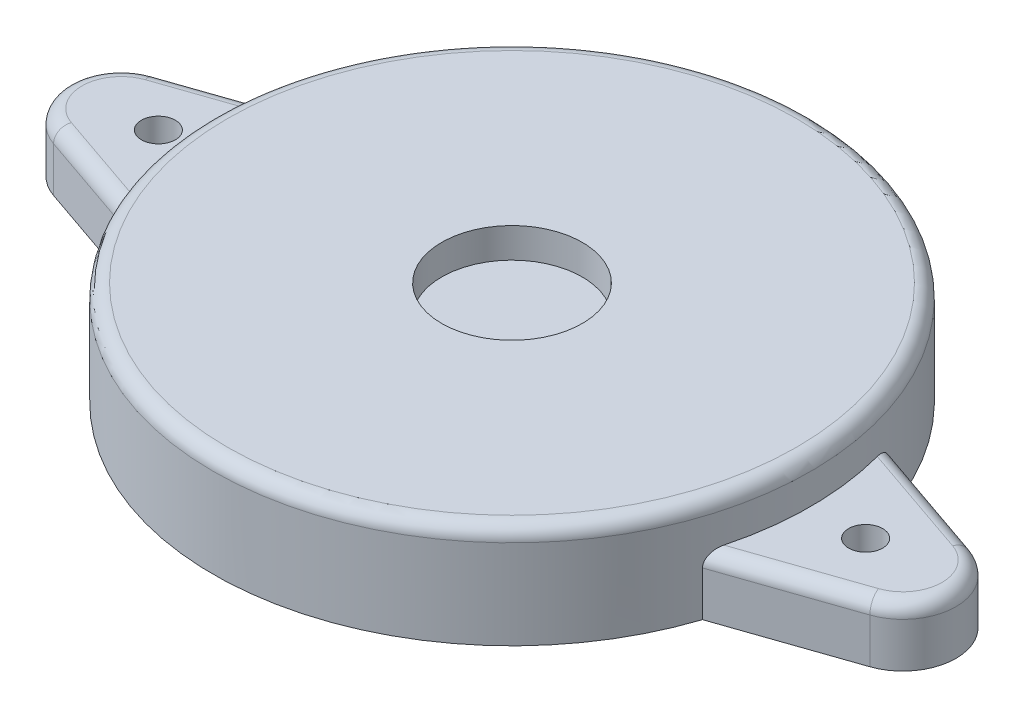
ISO-10303-21;
HEADER;
FILE_DESCRIPTION(('STEP AP214'),'2;1');
FILE_NAME('part.step','',(''),(''),'','','');
FILE_SCHEMA(('AUTOMOTIVE_DESIGN { 1 0 10303 214 1 1 1 1 }'));
ENDSEC;
DATA;
#1=APPLICATION_CONTEXT('core data for automotive mechanical design processes');
#2=APPLICATION_PROTOCOL_DEFINITION('international standard','automotive_design',2000,#1);
#3=PRODUCT_CONTEXT('',#1,'mechanical');
#4=PRODUCT('Part','Part','',(#3));
#5=PRODUCT_RELATED_PRODUCT_CATEGORY('part','',(#4));
#6=PRODUCT_DEFINITION_FORMATION('','',#4);
#7=PRODUCT_DEFINITION_CONTEXT('part definition',#1,'design');
#8=PRODUCT_DEFINITION('design','',#6,#7);
#9=PRODUCT_DEFINITION_SHAPE('','',#8);
#10=(LENGTH_UNIT() NAMED_UNIT(*) SI_UNIT(.MILLI.,.METRE.));
#11=(NAMED_UNIT(*) PLANE_ANGLE_UNIT() SI_UNIT($,.RADIAN.));
#12=(NAMED_UNIT(*) SI_UNIT($,.STERADIAN.) SOLID_ANGLE_UNIT());
#13=UNCERTAINTY_MEASURE_WITH_UNIT(LENGTH_MEASURE(1.E-05),#10,'distance_accuracy_value','');
#14=(GEOMETRIC_REPRESENTATION_CONTEXT(3) GLOBAL_UNCERTAINTY_ASSIGNED_CONTEXT((#13)) GLOBAL_UNIT_ASSIGNED_CONTEXT((#10,
#11,#12)) REPRESENTATION_CONTEXT('',''));
#15=CARTESIAN_POINT('',(0.,0.,0.));
#16=DIRECTION('',(0.,0.,1.));
#17=DIRECTION('',(1.,0.,0.));
#18=AXIS2_PLACEMENT_3D('',#15,#16,#17);
#19=CARTESIAN_POINT('',(0.,5.16,0.));
#20=DIRECTION('',(0.,-1.,0.));
#21=DIRECTION('',(0.,0.,-1.));
#22=AXIS2_PLACEMENT_3D('',#19,#20,#21);
#23=CYLINDRICAL_SURFACE('',#22,14.93);
#24=CARTESIAN_POINT('',(0.,4.46,0.));
#25=DIRECTION('',(0.,1.,0.));
#26=DIRECTION('',(0.,0.,1.));
#27=AXIS2_PLACEMENT_3D('',#24,#25,#26);
#28=CIRCLE('',#27,14.93);
#29=CARTESIAN_POINT('',(0.,4.46,14.93));
#30=VERTEX_POINT('',#29);
#31=EDGE_CURVE('E200',#30,#30,#28,.F.);
#32=ORIENTED_EDGE('',*,*,#31,.T.);
#33=EDGE_LOOP('',(#32));
#34=FACE_BOUND('',#33,.T.);
#35=CARTESIAN_POINT('',(0.,2.94,0.));
#36=DIRECTION('',(0.,-1.,0.));
#37=DIRECTION('',(0.,0.,-1.));
#38=AXIS2_PLACEMENT_3D('',#35,#36,#37);
#39=CIRCLE('',#38,14.93);
#40=CARTESIAN_POINT('',(-14.429087598297,2.94,3.8348834507287));
#41=VERTEX_POINT('',#40);
#42=CARTESIAN_POINT('',(-14.429087598297,2.94,-3.8348834507287));
#43=VERTEX_POINT('',#42);
#44=EDGE_CURVE('E161',#41,#43,#39,.T.);
#45=ORIENTED_EDGE('',*,*,#44,.F.);
#46=CARTESIAN_POINT('',(-14.429087598297,2.94,3.8348834507287));
#47=CARTESIAN_POINT('',(-14.4138774173166,2.93997814055828,3.8921743099573));
#48=CARTESIAN_POINT('',(-14.3982845537592,2.93480887956589,3.94941011262203));
#49=CARTESIAN_POINT('',(-14.3667965768096,2.91417210982097,4.06243771924972));
#50=CARTESIAN_POINT('',(-14.3509000239146,2.89861824672489,4.11821330467232));
#51=CARTESIAN_POINT('',(-14.3202531008862,2.85814754029159,4.22352402585155));
#52=CARTESIAN_POINT('',(-14.305483406981,2.83368591733759,4.2732273044714));
#53=CARTESIAN_POINT('',(-14.2771239902179,2.77541682636606,4.3670362653395));
#54=CARTESIAN_POINT('',(-14.2635295644546,2.74164911083228,4.41116461783673));
#55=CARTESIAN_POINT('',(-14.242478513252,2.67726120224456,4.47856390047529));
#56=CARTESIAN_POINT('',(-14.2344480605328,2.64907861241899,4.50399564814046));
#57=CARTESIAN_POINT('',(-14.219760478293,2.58871728969254,4.5501534800078));
#58=CARTESIAN_POINT('',(-14.2131033739341,2.5565384835928,4.57087947799488));
#59=CARTESIAN_POINT('',(-14.2015511147571,2.48845281904667,4.60664798740863));
#60=CARTESIAN_POINT('',(-14.1966728144079,2.45251425129202,4.6216361955794));
#61=CARTESIAN_POINT('',(-14.1892028208415,2.37825680983918,4.64452074193722));
#62=CARTESIAN_POINT('',(-14.1866043877521,2.33994531310194,4.65243798496127));
#63=CARTESIAN_POINT('',(-14.1849214181625,2.29108472920955,4.6575642029491));
#64=CARTESIAN_POINT('',(-14.1846584788022,2.28087987559489,4.6583649206828));
#65=CARTESIAN_POINT('',(-14.1843080413889,2.26045175313608,4.65943195312917));
#66=CARTESIAN_POINT('',(-14.184220329351,2.25022852203119,4.659698919651));
#67=CARTESIAN_POINT('',(-14.1842199529482,2.24,4.65970002536481));
#68=B_SPLINE_CURVE_WITH_KNOTS('',3,(#46,#47,#48,#49,#50,#51,#52,#53,#54,#55,#56,#57,#58,#59,#60,
#61,#62,#63,#64,#65,#66,#67),.UNSPECIFIED.,.F.,.F.,(4,2,2,2,2,2,2,2,2,2,4),(0.,
0.177689420451845,0.356875152519502,0.527957754312332,0.698320583460933,0.814287444919781,
0.930256430862166,1.04729732013803,1.16399102929701,1.19469972106421,1.22537088886555),.UNSPECIFIED.);
#69=CARTESIAN_POINT('',(-14.1842199529482,2.24,4.65970002536481));
#70=VERTEX_POINT('',#69);
#71=EDGE_CURVE('E44',#41,#70,#68,.T.);
#72=ORIENTED_EDGE('',*,*,#71,.T.);
#73=DIRECTION('',(0.,-1.,0.));
#74=VECTOR('',#73,1.);
#75=CARTESIAN_POINT('',(-14.1842199529482,2.94,4.65970002536481));
#76=LINE('',#75,#74);
#77=CARTESIAN_POINT('',(-14.1842199529482,0.,4.65970002536481));
#78=VERTEX_POINT('',#77);
#79=EDGE_CURVE('E136',#70,#78,#76,.T.);
#80=ORIENTED_EDGE('',*,*,#79,.T.);
#81=CARTESIAN_POINT('',(0.,0.,0.));
#82=DIRECTION('',(0.,1.,0.));
#83=DIRECTION('',(0.,0.,1.));
#84=AXIS2_PLACEMENT_3D('',#81,#82,#83);
#85=CIRCLE('',#84,14.93);
#86=CARTESIAN_POINT('',(14.1842199529483,0.,4.65970002536481));
#87=VERTEX_POINT('',#86);
#88=EDGE_CURVE('E148',#78,#87,#85,.T.);
#89=ORIENTED_EDGE('',*,*,#88,.T.);
#90=DIRECTION('',(0.,-1.,0.));
#91=VECTOR('',#90,1.);
#92=CARTESIAN_POINT('',(14.1842199529482,2.94,4.65970002536481));
#93=LINE('',#92,#91);
#94=CARTESIAN_POINT('',(14.1842199529482,2.24,4.65970002536481));
#95=VERTEX_POINT('',#94);
#96=EDGE_CURVE('E192',#95,#87,#93,.T.);
#97=ORIENTED_EDGE('',*,*,#96,.F.);
#98=CARTESIAN_POINT('',(14.1842199529482,2.24,4.65970002536481));
#99=CARTESIAN_POINT('',(14.1842190896717,2.25693649452195,4.65970201646287));
#100=CARTESIAN_POINT('',(14.184461026523,2.27386343904716,4.6589662491817));
#101=CARTESIAN_POINT('',(14.1854202016541,2.30756925031859,4.65604524308534));
#102=CARTESIAN_POINT('',(14.1861371831797,2.32434819209661,4.65386078726296));
#103=CARTESIAN_POINT('',(14.1889722437595,2.37406195090137,4.64521313316511));
#104=CARTESIAN_POINT('',(14.1917747600945,2.40661629321092,4.63665481022352));
#105=CARTESIAN_POINT('',(14.1989974675529,2.46965652039576,4.61448848816677));
#106=CARTESIAN_POINT('',(14.2034147720633,2.50014598190755,4.60088949919917));
#107=CARTESIAN_POINT('',(14.2135990146769,2.55856601677584,4.5693300993658));
#108=CARTESIAN_POINT('',(14.219367887,2.58649284229407,4.55136343655123));
#109=CARTESIAN_POINT('',(14.2324496611259,2.64139553893826,4.5102964837884));
#110=CARTESIAN_POINT('',(14.239847031579,2.66813434631393,4.48690821546017));
#111=CARTESIAN_POINT('',(14.255543759827,2.71792964715898,4.4367851705581));
#112=CARTESIAN_POINT('',(14.2638433119251,2.74098534474529,4.41004967290192));
#113=CARTESIAN_POINT('',(14.282757982286,2.78748441236427,4.34844257702542));
#114=CARTESIAN_POINT('',(14.2935083015561,2.81011977276594,4.3130029102126));
#115=CARTESIAN_POINT('',(14.3155306560991,2.84999580013863,4.23933536231764));
#116=CARTESIAN_POINT('',(14.326803306577,2.86722991003768,4.2011041611923));
#117=CARTESIAN_POINT('',(14.3516786781012,2.89899127627244,4.11540518367075));
#118=CARTESIAN_POINT('',(14.3653248558078,2.91241908179589,4.06754191138568));
#119=CARTESIAN_POINT('',(14.3924909249222,2.93160860206077,3.97034534492567));
#120=CARTESIAN_POINT('',(14.4060109908642,2.93738324223114,3.92101467352165));
#121=CARTESIAN_POINT('',(14.4225769534227,2.9397641173255,3.85931833082634));
#122=CARTESIAN_POINT('',(14.4258406872819,2.94000004110343,3.8471010798203));
#123=CARTESIAN_POINT('',(14.429087598297,2.94,3.8348834507287));
#124=B_SPLINE_CURVE_WITH_KNOTS('',3,(#98,#99,#100,#101,#102,#103,#104,#105,#106,#107,#108,#109,
#110,#111,#112,#113,#114,#115,#116,#117,#118,#119,#120,#121,#122,#123),.UNSPECIFIED.,.F.,.F.,(4,
2,2,2,2,2,2,2,2,2,2,2,4),(0.,0.0507734722109093,0.101519524519104,0.202294433131119,
0.302890069371643,0.403630556349275,0.512094664936698,0.620582179917424,0.750311736923561,
0.880198179861179,1.03423986539473,1.18802105701897,1.22595505623296),.UNSPECIFIED.);
#125=CARTESIAN_POINT('',(14.429087598297,2.94,3.8348834507287));
#126=VERTEX_POINT('',#125);
#127=EDGE_CURVE('E11',#95,#126,#124,.T.);
#128=ORIENTED_EDGE('',*,*,#127,.T.);
#129=CARTESIAN_POINT('',(0.,2.94,0.));
#130=DIRECTION('',(0.,-1.,0.));
#131=DIRECTION('',(0.,0.,1.));
#132=AXIS2_PLACEMENT_3D('',#129,#130,#131);
#133=CIRCLE('',#132,14.93);
#134=CARTESIAN_POINT('',(14.429087598297,2.94,-3.8348834507287));
#135=VERTEX_POINT('',#134);
#136=EDGE_CURVE('E175',#135,#126,#133,.T.);
#137=ORIENTED_EDGE('',*,*,#136,.F.);
#138=CARTESIAN_POINT('',(14.429087598297,2.94,-3.8348834507287));
#139=CARTESIAN_POINT('',(14.4138774173166,2.93997814055828,-3.8921743099573));
#140=CARTESIAN_POINT('',(14.3982845537592,2.93480887956589,-3.94941011262203));
#141=CARTESIAN_POINT('',(14.3667965768096,2.91417210982097,-4.06243771924972));
#142=CARTESIAN_POINT('',(14.3509000239146,2.89861824672489,-4.11821330467232));
#143=CARTESIAN_POINT('',(14.3202531008862,2.85814754029159,-4.22352402585155));
#144=CARTESIAN_POINT('',(14.305483406981,2.83368591733758,-4.2732273044714));
#145=CARTESIAN_POINT('',(14.2771239902179,2.77541682636606,-4.3670362653395));
#146=CARTESIAN_POINT('',(14.2635295644546,2.74164911083227,-4.41116461783674));
#147=CARTESIAN_POINT('',(14.242478513252,2.67726120224456,-4.47856390047529));
#148=CARTESIAN_POINT('',(14.2344480605328,2.64907861241899,-4.50399564814046));
#149=CARTESIAN_POINT('',(14.219760478293,2.58871728969254,-4.5501534800078));
#150=CARTESIAN_POINT('',(14.2131033739341,2.5565384835928,-4.57087947799488));
#151=CARTESIAN_POINT('',(14.2015511147571,2.48845281904666,-4.60664798740864));
#152=CARTESIAN_POINT('',(14.1966728144079,2.45251425129201,-4.6216361955794));
#153=CARTESIAN_POINT('',(14.1892028208415,2.37825680983918,-4.64452074193722));
#154=CARTESIAN_POINT('',(14.1866043877521,2.33994531310193,-4.65243798496127));
#155=CARTESIAN_POINT('',(14.1849214181625,2.29108472920955,-4.6575642029491));
#156=CARTESIAN_POINT('',(14.1846584788022,2.28087987559489,-4.6583649206828));
#157=CARTESIAN_POINT('',(14.1843080413889,2.26045175313608,-4.65943195312917));
#158=CARTESIAN_POINT('',(14.184220329351,2.25022852203119,-4.659698919651));
#159=CARTESIAN_POINT('',(14.1842199529482,2.24,-4.65970002536481));
#160=B_SPLINE_CURVE_WITH_KNOTS('',3,(#138,#139,#140,#141,#142,#143,#144,#145,#146,#147,#148,
#149,#150,#151,#152,#153,#154,#155,#156,#157,#158,#159),.UNSPECIFIED.,.F.,.F.,(4,2,2,2,2,2,2,2,
2,2,4),(0.,0.177689420451847,0.356875152519503,0.527957754312334,0.698320583460934,
0.814287444919785,0.930256430862171,1.04729732013804,1.16399102929701,1.19469972106422,
1.22537088886555),.UNSPECIFIED.);
#161=CARTESIAN_POINT('',(14.1842199529482,2.24,-4.65970002536481));
#162=VERTEX_POINT('',#161);
#163=EDGE_CURVE('E235',#135,#162,#160,.T.);
#164=ORIENTED_EDGE('',*,*,#163,.T.);
#165=DIRECTION('',(0.,-1.,0.));
#166=VECTOR('',#165,1.);
#167=CARTESIAN_POINT('',(14.1842199529482,2.94,-4.65970002536481));
#168=LINE('',#167,#166);
#169=CARTESIAN_POINT('',(14.1842199529482,0.,-4.65970002536481));
#170=VERTEX_POINT('',#169);
#171=EDGE_CURVE('E178',#162,#170,#168,.T.);
#172=ORIENTED_EDGE('',*,*,#171,.T.);
#173=CARTESIAN_POINT('',(-14.1842199529483,0.,-4.65970002536481));
#174=VERTEX_POINT('',#173);
#175=EDGE_CURVE('E194',#170,#174,#85,.T.);
#176=ORIENTED_EDGE('',*,*,#175,.T.);
#177=DIRECTION('',(0.,-1.,0.));
#178=VECTOR('',#177,1.);
#179=CARTESIAN_POINT('',(-14.1842199529482,2.94,-4.65970002536481));
#180=LINE('',#179,#178);
#181=CARTESIAN_POINT('',(-14.1842199529482,2.24,-4.65970002536481));
#182=VERTEX_POINT('',#181);
#183=EDGE_CURVE('E166',#182,#174,#180,.T.);
#184=ORIENTED_EDGE('',*,*,#183,.F.);
#185=CARTESIAN_POINT('',(-14.1842199529482,2.24,-4.65970002536481));
#186=CARTESIAN_POINT('',(-14.1842190896717,2.25693649452195,-4.65970201646287));
#187=CARTESIAN_POINT('',(-14.184461026523,2.27386343904716,-4.6589662491817));
#188=CARTESIAN_POINT('',(-14.1854202016541,2.30756925031859,-4.65604524308534));
#189=CARTESIAN_POINT('',(-14.1861371831797,2.32434819209661,-4.65386078726296));
#190=CARTESIAN_POINT('',(-14.1889722437595,2.37406195090137,-4.64521313316511));
#191=CARTESIAN_POINT('',(-14.1917747600945,2.40661629321092,-4.63665481022352));
#192=CARTESIAN_POINT('',(-14.1989974675529,2.46965652039576,-4.61448848816677));
#193=CARTESIAN_POINT('',(-14.2034147720633,2.50014598190755,-4.60088949919916));
#194=CARTESIAN_POINT('',(-14.2135990146769,2.55856601677584,-4.5693300993658));
#195=CARTESIAN_POINT('',(-14.219367887,2.58649284229407,-4.55136343655123));
#196=CARTESIAN_POINT('',(-14.2324496611259,2.64139553893826,-4.5102964837884));
#197=CARTESIAN_POINT('',(-14.239847031579,2.66813434631393,-4.48690821546017));
#198=CARTESIAN_POINT('',(-14.255543759827,2.71792964715898,-4.4367851705581));
#199=CARTESIAN_POINT('',(-14.2638433119251,2.74098534474529,-4.41004967290191));
#200=CARTESIAN_POINT('',(-14.282757982286,2.78748441236427,-4.34844257702541));
#201=CARTESIAN_POINT('',(-14.2935083015561,2.81011977276594,-4.3130029102126));
#202=CARTESIAN_POINT('',(-14.3155306560991,2.84999580013863,-4.23933536231764));
#203=CARTESIAN_POINT('',(-14.326803306577,2.86722991003768,-4.2011041611923));
#204=CARTESIAN_POINT('',(-14.3516786781012,2.89899127627244,-4.11540518367075));
#205=CARTESIAN_POINT('',(-14.3653248558078,2.91241908179589,-4.06754191138568));
#206=CARTESIAN_POINT('',(-14.3924909249222,2.93160860206077,-3.97034534492567));
#207=CARTESIAN_POINT('',(-14.4060109908642,2.93738324223114,-3.92101467352165));
#208=CARTESIAN_POINT('',(-14.4225769534227,2.9397641173255,-3.85931833082634));
#209=CARTESIAN_POINT('',(-14.4258406872819,2.94000004110343,-3.8471010798203));
#210=CARTESIAN_POINT('',(-14.429087598297,2.94,-3.8348834507287));
#211=B_SPLINE_CURVE_WITH_KNOTS('',3,(#185,#186,#187,#188,#189,#190,#191,#192,#193,#194,#195,
#196,#197,#198,#199,#200,#201,#202,#203,#204,#205,#206,#207,#208,#209,#210),.UNSPECIFIED.,.F.,
.F.,(4,2,2,2,2,2,2,2,2,2,2,2,4),(0.,0.0507734722109094,0.101519524519103,0.202294433131119,
0.302890069371642,0.403630556349275,0.512094664936698,0.620582179917423,0.75031173692356,
0.880198179861176,1.03423986539473,1.18802105701897,1.22595505623296),.UNSPECIFIED.);
#212=EDGE_CURVE('E227',#182,#43,#211,.T.);
#213=ORIENTED_EDGE('',*,*,#212,.T.);
#214=EDGE_LOOP('',(#45,#72,#80,#89,#97,#128,#137,#164,#172,#176,#184,#213));
#215=FACE_BOUND('',#214,.T.);
#216=ADVANCED_FACE('F34',(#34,#215),#23,.T.);
#217=CARTESIAN_POINT('',(0.,5.16,0.));
#218=DIRECTION('',(0.,1.,0.));
#219=DIRECTION('',(0.,0.,1.));
#220=AXIS2_PLACEMENT_3D('',#217,#218,#219);
#221=PLANE('',#220);
#222=CARTESIAN_POINT('',(0.,5.16,0.));
#223=DIRECTION('',(0.,1.,0.));
#224=DIRECTION('',(0.,0.,1.));
#225=AXIS2_PLACEMENT_3D('',#222,#223,#224);
#226=CIRCLE('',#225,3.515);
#227=CARTESIAN_POINT('',(0.,5.16,3.515));
#228=VERTEX_POINT('',#227);
#229=EDGE_CURVE('E283',#228,#228,#226,.T.);
#230=ORIENTED_EDGE('',*,*,#229,.F.);
#231=EDGE_LOOP('',(#230));
#232=FACE_BOUND('',#231,.T.);
#233=CARTESIAN_POINT('',(0.,5.16,0.));
#234=DIRECTION('',(0.,1.,0.));
#235=DIRECTION('',(0.,0.,1.));
#236=AXIS2_PLACEMENT_3D('',#233,#234,#235);
#237=CIRCLE('',#236,14.23);
#238=CARTESIAN_POINT('',(0.,5.16,14.23));
#239=VERTEX_POINT('',#238);
#240=EDGE_CURVE('E197',#239,#239,#237,.T.);
#241=ORIENTED_EDGE('',*,*,#240,.T.);
#242=EDGE_LOOP('',(#241));
#243=FACE_BOUND('',#242,.T.);
#244=ADVANCED_FACE('F308',(#232,#243),#221,.T.);
#245=CARTESIAN_POINT('',(0.,0.,0.));
#246=DIRECTION('',(0.,1.,0.));
#247=DIRECTION('',(0.,0.,1.));
#248=AXIS2_PLACEMENT_3D('',#245,#246,#247);
#249=PLANE('',#248);
#250=ORIENTED_EDGE('',*,*,#175,.F.);
#251=DIRECTION('',(-0.945415498264678,0.,-0.325867358968263));
#252=VECTOR('',#251,1.);
#253=CARTESIAN_POINT('',(14.1842199529482,0.,-4.65970002536481));
#254=LINE('',#253,#252);
#255=CARTESIAN_POINT('',(20.4067284526636,0.,-2.51491562667268));
#256=VERTEX_POINT('',#255);
#257=EDGE_CURVE('E179',#256,#170,#254,.T.);
#258=ORIENTED_EDGE('',*,*,#257,.F.);
#259=CARTESIAN_POINT('',(19.5398832245115,0.,0.));
#260=DIRECTION('',(0.,1.,0.));
#261=DIRECTION('',(0.,0.,1.));
#262=AXIS2_PLACEMENT_3D('',#259,#260,#261);
#263=CIRCLE('',#262,2.66011677541656);
#264=CARTESIAN_POINT('',(20.4067284526636,0.,2.51491562667268));
#265=VERTEX_POINT('',#264);
#266=EDGE_CURVE('E182',#265,#256,#263,.T.);
#267=ORIENTED_EDGE('',*,*,#266,.F.);
#268=DIRECTION('',(0.945415498264678,0.,-0.325867358968263));
#269=VECTOR('',#268,1.);
#270=CARTESIAN_POINT('',(14.1842199529482,0.,4.65970002536481));
#271=LINE('',#270,#269);
#272=EDGE_CURVE('E172',#87,#265,#271,.T.);
#273=ORIENTED_EDGE('',*,*,#272,.F.);
#274=ORIENTED_EDGE('',*,*,#88,.F.);
#275=DIRECTION('',(0.945415498264678,0.,0.325867358968263));
#276=VECTOR('',#275,1.);
#277=CARTESIAN_POINT('',(-14.1842199529482,0.,4.65970002536481));
#278=LINE('',#277,#276);
#279=CARTESIAN_POINT('',(-20.4067284526636,0.,2.51491562667268));
#280=VERTEX_POINT('',#279);
#281=EDGE_CURVE('E129',#280,#78,#278,.T.);
#282=ORIENTED_EDGE('',*,*,#281,.F.);
#283=CARTESIAN_POINT('',(-19.5398832245115,0.,0.));
#284=DIRECTION('',(0.,1.,0.));
#285=DIRECTION('',(0.,0.,-1.));
#286=AXIS2_PLACEMENT_3D('',#283,#284,#285);
#287=CIRCLE('',#286,2.66011677541656);
#288=CARTESIAN_POINT('',(-20.4067284526636,0.,-2.51491562667268));
#289=VERTEX_POINT('',#288);
#290=EDGE_CURVE('E145',#289,#280,#287,.T.);
#291=ORIENTED_EDGE('',*,*,#290,.F.);
#292=DIRECTION('',(-0.945415498264678,0.,0.325867358968263));
#293=VECTOR('',#292,1.);
#294=CARTESIAN_POINT('',(-14.1842199529482,0.,-4.65970002536481));
#295=LINE('',#294,#293);
#296=EDGE_CURVE('E149',#174,#289,#295,.T.);
#297=ORIENTED_EDGE('',*,*,#296,.F.);
#298=EDGE_LOOP('',(#250,#258,#267,#273,#274,#282,#291,#297));
#299=FACE_BOUND('',#298,.T.);
#300=CARTESIAN_POINT('',(17.679999999928,0.,0.));
#301=DIRECTION('',(0.,1.,0.));
#302=DIRECTION('',(0.,0.,1.));
#303=AXIS2_PLACEMENT_3D('',#300,#301,#302);
#304=CIRCLE('',#303,0.85);
#305=CARTESIAN_POINT('',(17.679999999928,0.,0.85));
#306=VERTEX_POINT('',#305);
#307=EDGE_CURVE('E135',#306,#306,#304,.T.);
#308=ORIENTED_EDGE('',*,*,#307,.T.);
#309=EDGE_LOOP('',(#308));
#310=FACE_BOUND('',#309,.T.);
#311=CARTESIAN_POINT('',(-17.679999999928,0.,0.));
#312=DIRECTION('',(0.,1.,0.));
#313=DIRECTION('',(0.,0.,-1.));
#314=AXIS2_PLACEMENT_3D('',#311,#312,#313);
#315=CIRCLE('',#314,0.85);
#316=CARTESIAN_POINT('',(-17.679999999928,0.,-0.849999999999999));
#317=VERTEX_POINT('',#316);
#318=EDGE_CURVE('E158',#317,#317,#315,.T.);
#319=ORIENTED_EDGE('',*,*,#318,.T.);
#320=EDGE_LOOP('',(#319));
#321=FACE_BOUND('',#320,.T.);
#322=ADVANCED_FACE('F142',(#299,#310,#321),#249,.F.);
#323=CARTESIAN_POINT('',(0.,2.94,0.));
#324=DIRECTION('',(0.,1.,0.));
#325=DIRECTION('',(0.,0.,1.));
#326=AXIS2_PLACEMENT_3D('',#323,#324,#325);
#327=PLANE('',#326);
#328=CARTESIAN_POINT('',(19.5398832245115,2.94,0.));
#329=DIRECTION('',(0.,1.,0.));
#330=DIRECTION('',(0.,0.,1.));
#331=AXIS2_PLACEMENT_3D('',#328,#329,#330);
#332=CIRCLE('',#331,1.96011677541656);
#333=CARTESIAN_POINT('',(20.1786213013859,2.94,1.8531247778874));
#334=VERTEX_POINT('',#333);
#335=CARTESIAN_POINT('',(20.1786213013859,2.94,-1.8531247778874));
#336=VERTEX_POINT('',#335);
#337=EDGE_CURVE('E216',#334,#336,#332,.T.);
#338=ORIENTED_EDGE('',*,*,#337,.T.);
#339=DIRECTION('',(-0.945415498264678,0.,-0.325867358968263));
#340=VECTOR('',#339,1.);
#341=CARTESIAN_POINT('',(13.9561128016705,2.94,-3.99790917657953));
#342=LINE('',#341,#340);
#343=EDGE_CURVE('E218',#336,#135,#342,.T.);
#344=ORIENTED_EDGE('',*,*,#343,.T.);
#345=ORIENTED_EDGE('',*,*,#136,.T.);
#346=DIRECTION('',(0.945415498264678,0.,-0.325867358968263));
#347=VECTOR('',#346,1.);
#348=CARTESIAN_POINT('',(20.1786213013859,2.94,1.8531247778874));
#349=LINE('',#348,#347);
#350=EDGE_CURVE('E214',#126,#334,#349,.T.);
#351=ORIENTED_EDGE('',*,*,#350,.T.);
#352=EDGE_LOOP('',(#338,#344,#345,#351));
#353=FACE_BOUND('',#352,.T.);
#354=CARTESIAN_POINT('',(17.679999999928,2.94,0.));
#355=DIRECTION('',(0.,1.,0.));
#356=DIRECTION('',(0.,0.,1.));
#357=AXIS2_PLACEMENT_3D('',#354,#355,#356);
#358=CIRCLE('',#357,0.85);
#359=CARTESIAN_POINT('',(17.679999999928,2.94,0.85));
#360=VERTEX_POINT('',#359);
#361=EDGE_CURVE('E169',#360,#360,#358,.T.);
#362=ORIENTED_EDGE('',*,*,#361,.F.);
#363=EDGE_LOOP('',(#362));
#364=FACE_BOUND('',#363,.T.);
#365=ADVANCED_FACE('F342',(#353,#364),#327,.T.);
#366=CARTESIAN_POINT('',(14.1842199529482,2.94,4.65970002536481));
#367=DIRECTION('',(-0.325867358968263,0.,-0.945415498264678));
#368=DIRECTION('',(-0.945415498264678,0.,0.325867358968263));
#369=AXIS2_PLACEMENT_3D('',#366,#367,#368);
#370=PLANE('',#369);
#371=DIRECTION('',(0.,-1.,0.));
#372=VECTOR('',#371,1.);
#373=CARTESIAN_POINT('',(20.4067284526636,2.94,2.51491562667268));
#374=LINE('',#373,#372);
#375=CARTESIAN_POINT('',(20.4067284526636,2.24,2.51491562667268));
#376=VERTEX_POINT('',#375);
#377=EDGE_CURVE('E190',#376,#265,#374,.T.);
#378=ORIENTED_EDGE('',*,*,#377,.F.);
#379=DIRECTION('',(0.945415498264678,0.,-0.325867358968263));
#380=VECTOR('',#379,1.);
#381=CARTESIAN_POINT('',(14.1842199529482,2.24,4.65970002536481));
#382=LINE('',#381,#380);
#383=EDGE_CURVE('E52',#376,#95,#382,.F.);
#384=ORIENTED_EDGE('',*,*,#383,.T.);
#385=ORIENTED_EDGE('',*,*,#96,.T.);
#386=ORIENTED_EDGE('',*,*,#272,.T.);
#387=EDGE_LOOP('',(#378,#384,#385,#386));
#388=FACE_BOUND('',#387,.T.);
#389=ADVANCED_FACE('F345',(#388),#370,.F.);
#390=CARTESIAN_POINT('',(19.5398832245115,2.94,0.));
#391=DIRECTION('',(0.,-1.,0.));
#392=DIRECTION('',(0.,0.,-1.));
#393=AXIS2_PLACEMENT_3D('',#390,#391,#392);
#394=CYLINDRICAL_SURFACE('',#393,2.66011677541656);
#395=DIRECTION('',(0.,-1.,0.));
#396=VECTOR('',#395,1.);
#397=CARTESIAN_POINT('',(20.4067284526636,2.94,-2.51491562667268));
#398=LINE('',#397,#396);
#399=CARTESIAN_POINT('',(20.4067284526636,2.24,-2.51491562667268));
#400=VERTEX_POINT('',#399);
#401=EDGE_CURVE('E188',#400,#256,#398,.T.);
#402=ORIENTED_EDGE('',*,*,#401,.F.);
#403=CARTESIAN_POINT('',(19.5398832245115,2.24,0.));
#404=DIRECTION('',(0.,1.,0.));
#405=DIRECTION('',(0.,0.,1.));
#406=AXIS2_PLACEMENT_3D('',#403,#404,#405);
#407=CIRCLE('',#406,2.66011677541656);
#408=EDGE_CURVE('E223',#400,#376,#407,.F.);
#409=ORIENTED_EDGE('',*,*,#408,.T.);
#410=ORIENTED_EDGE('',*,*,#377,.T.);
#411=ORIENTED_EDGE('',*,*,#266,.T.);
#412=EDGE_LOOP('',(#402,#409,#410,#411));
#413=FACE_BOUND('',#412,.T.);
#414=ADVANCED_FACE('F349',(#413),#394,.T.);
#415=CARTESIAN_POINT('',(14.1842199529482,2.94,-4.65970002536481));
#416=DIRECTION('',(-0.325867358968263,0.,0.945415498264678));
#417=DIRECTION('',(0.945415498264678,0.,0.325867358968263));
#418=AXIS2_PLACEMENT_3D('',#415,#416,#417);
#419=PLANE('',#418);
#420=ORIENTED_EDGE('',*,*,#171,.F.);
#421=DIRECTION('',(-0.945415498264678,0.,-0.325867358968263));
#422=VECTOR('',#421,1.);
#423=CARTESIAN_POINT('',(20.4067284526636,2.24,-2.51491562667268));
#424=LINE('',#423,#422);
#425=EDGE_CURVE('E221',#162,#400,#424,.F.);
#426=ORIENTED_EDGE('',*,*,#425,.T.);
#427=ORIENTED_EDGE('',*,*,#401,.T.);
#428=ORIENTED_EDGE('',*,*,#257,.T.);
#429=EDGE_LOOP('',(#420,#426,#427,#428));
#430=FACE_BOUND('',#429,.T.);
#431=ADVANCED_FACE('F336',(#430),#419,.F.);
#432=CARTESIAN_POINT('',(17.679999999928,2.94,0.));
#433=DIRECTION('',(0.,-1.,0.));
#434=DIRECTION('',(0.,0.,-1.));
#435=AXIS2_PLACEMENT_3D('',#432,#433,#434);
#436=CYLINDRICAL_SURFACE('',#435,0.85);
#437=ORIENTED_EDGE('',*,*,#361,.T.);
#438=EDGE_LOOP('',(#437));
#439=FACE_BOUND('',#438,.T.);
#440=ORIENTED_EDGE('',*,*,#307,.F.);
#441=EDGE_LOOP('',(#440));
#442=FACE_BOUND('',#441,.T.);
#443=ADVANCED_FACE('F329',(#439,#442),#436,.F.);
#444=CARTESIAN_POINT('',(-19.5398832245115,2.94,0.));
#445=DIRECTION('',(0.,-1.,0.));
#446=DIRECTION('',(0.,0.,-1.));
#447=AXIS2_PLACEMENT_3D('',#444,#445,#446);
#448=PLANE('',#447);
#449=ORIENTED_EDGE('',*,*,#44,.T.);
#450=DIRECTION('',(-0.945415498264678,0.,0.325867358968263));
#451=VECTOR('',#450,1.);
#452=CARTESIAN_POINT('',(-20.1786213013859,2.94,-1.8531247778874));
#453=LINE('',#452,#451);
#454=CARTESIAN_POINT('',(-20.1786213013859,2.94,-1.8531247778874));
#455=VERTEX_POINT('',#454);
#456=EDGE_CURVE('E207',#43,#455,#453,.T.);
#457=ORIENTED_EDGE('',*,*,#456,.T.);
#458=CARTESIAN_POINT('',(-19.5398832245115,2.94,0.));
#459=DIRECTION('',(0.,-1.,0.));
#460=DIRECTION('',(0.,0.,-1.));
#461=AXIS2_PLACEMENT_3D('',#458,#459,#460);
#462=CIRCLE('',#461,1.96011677541656);
#463=CARTESIAN_POINT('',(-20.1786213013859,2.94,1.8531247778874));
#464=VERTEX_POINT('',#463);
#465=EDGE_CURVE('E205',#455,#464,#462,.F.);
#466=ORIENTED_EDGE('',*,*,#465,.T.);
#467=DIRECTION('',(0.945415498264678,0.,0.325867358968263));
#468=VECTOR('',#467,1.);
#469=CARTESIAN_POINT('',(-20.1786213013859,2.94,1.8531247778874));
#470=LINE('',#469,#468);
#471=EDGE_CURVE('E203',#464,#41,#470,.T.);
#472=ORIENTED_EDGE('',*,*,#471,.T.);
#473=EDGE_LOOP('',(#449,#457,#466,#472));
#474=FACE_BOUND('',#473,.T.);
#475=CARTESIAN_POINT('',(-17.679999999928,2.94,0.));
#476=DIRECTION('',(0.,1.,0.));
#477=DIRECTION('',(0.,0.,-1.));
#478=AXIS2_PLACEMENT_3D('',#475,#476,#477);
#479=CIRCLE('',#478,0.85);
#480=CARTESIAN_POINT('',(-17.679999999928,2.94,-0.849999999999999));
#481=VERTEX_POINT('',#480);
#482=EDGE_CURVE('E155',#481,#481,#479,.T.);
#483=ORIENTED_EDGE('',*,*,#482,.F.);
#484=EDGE_LOOP('',(#483));
#485=FACE_BOUND('',#484,.T.);
#486=ADVANCED_FACE('F326',(#474,#485),#448,.F.);
#487=CARTESIAN_POINT('',(-19.5398832245115,2.94,0.));
#488=DIRECTION('',(0.,-1.,0.));
#489=DIRECTION('',(0.,0.,-1.));
#490=AXIS2_PLACEMENT_3D('',#487,#488,#489);
#491=CYLINDRICAL_SURFACE('',#490,2.66011677541656);
#492=DIRECTION('',(0.,-1.,0.));
#493=VECTOR('',#492,1.);
#494=CARTESIAN_POINT('',(-20.4067284526636,2.94,2.51491562667268));
#495=LINE('',#494,#493);
#496=CARTESIAN_POINT('',(-20.4067284526636,2.24,2.51491562667268));
#497=VERTEX_POINT('',#496);
#498=EDGE_CURVE('E126',#497,#280,#495,.T.);
#499=ORIENTED_EDGE('',*,*,#498,.F.);
#500=CARTESIAN_POINT('',(-19.5398832245115,2.24,0.));
#501=DIRECTION('',(0.,-1.,0.));
#502=DIRECTION('',(0.,0.,-1.));
#503=AXIS2_PLACEMENT_3D('',#500,#501,#502);
#504=CIRCLE('',#503,2.66011677541656);
#505=CARTESIAN_POINT('',(-20.4067284526636,2.24,-2.51491562667268));
#506=VERTEX_POINT('',#505);
#507=EDGE_CURVE('E212',#497,#506,#504,.T.);
#508=ORIENTED_EDGE('',*,*,#507,.T.);
#509=DIRECTION('',(0.,-1.,0.));
#510=VECTOR('',#509,1.);
#511=CARTESIAN_POINT('',(-20.4067284526636,2.94,-2.51491562667268));
#512=LINE('',#511,#510);
#513=EDGE_CURVE('E153',#506,#289,#512,.T.);
#514=ORIENTED_EDGE('',*,*,#513,.T.);
#515=ORIENTED_EDGE('',*,*,#290,.T.);
#516=EDGE_LOOP('',(#499,#508,#514,#515));
#517=FACE_BOUND('',#516,.T.);
#518=ADVANCED_FACE('F151',(#517),#491,.T.);
#519=CARTESIAN_POINT('',(-14.1842199529482,2.94,4.65970002536481));
#520=DIRECTION('',(0.325867358968263,0.,-0.945415498264678));
#521=DIRECTION('',(-0.945415498264678,0.,-0.325867358968263));
#522=AXIS2_PLACEMENT_3D('',#519,#520,#521);
#523=PLANE('',#522);
#524=ORIENTED_EDGE('',*,*,#79,.F.);
#525=DIRECTION('',(0.945415498264678,0.,0.325867358968263));
#526=VECTOR('',#525,1.);
#527=CARTESIAN_POINT('',(-14.1842199529482,2.24,4.65970002536481));
#528=LINE('',#527,#526);
#529=EDGE_CURVE('E131',#70,#497,#528,.F.);
#530=ORIENTED_EDGE('',*,*,#529,.T.);
#531=ORIENTED_EDGE('',*,*,#498,.T.);
#532=ORIENTED_EDGE('',*,*,#281,.T.);
#533=EDGE_LOOP('',(#524,#530,#531,#532));
#534=FACE_BOUND('',#533,.T.);
#535=ADVANCED_FACE('F128',(#534),#523,.F.);
#536=CARTESIAN_POINT('',(-14.1842199529482,2.94,-4.65970002536481));
#537=DIRECTION('',(0.325867358968263,0.,0.945415498264678));
#538=DIRECTION('',(0.945415498264678,0.,-0.325867358968263));
#539=AXIS2_PLACEMENT_3D('',#536,#537,#538);
#540=PLANE('',#539);
#541=ORIENTED_EDGE('',*,*,#513,.F.);
#542=DIRECTION('',(-0.945415498264678,0.,0.325867358968263));
#543=VECTOR('',#542,1.);
#544=CARTESIAN_POINT('',(-14.1842199529482,2.24,-4.65970002536481));
#545=LINE('',#544,#543);
#546=EDGE_CURVE('E210',#506,#182,#545,.F.);
#547=ORIENTED_EDGE('',*,*,#546,.T.);
#548=ORIENTED_EDGE('',*,*,#183,.T.);
#549=ORIENTED_EDGE('',*,*,#296,.T.);
#550=EDGE_LOOP('',(#541,#547,#548,#549));
#551=FACE_BOUND('',#550,.T.);
#552=ADVANCED_FACE('F295',(#551),#540,.F.);
#553=CARTESIAN_POINT('',(-17.679999999928,2.94,0.));
#554=DIRECTION('',(0.,-1.,0.));
#555=DIRECTION('',(0.,0.,-1.));
#556=AXIS2_PLACEMENT_3D('',#553,#554,#555);
#557=CYLINDRICAL_SURFACE('',#556,0.85);
#558=ORIENTED_EDGE('',*,*,#482,.T.);
#559=EDGE_LOOP('',(#558));
#560=FACE_BOUND('',#559,.T.);
#561=ORIENTED_EDGE('',*,*,#318,.F.);
#562=EDGE_LOOP('',(#561));
#563=FACE_BOUND('',#562,.T.);
#564=ADVANCED_FACE('F293',(#560,#563),#557,.F.);
#565=CARTESIAN_POINT('',(0.,4.46,0.));
#566=DIRECTION('',(0.,1.,0.));
#567=DIRECTION('',(0.,0.,1.));
#568=AXIS2_PLACEMENT_3D('',#565,#566,#567);
#569=TOROIDAL_SURFACE('',#568,14.23,0.7);
#570=ORIENTED_EDGE('',*,*,#31,.F.);
#571=EDGE_LOOP('',(#570));
#572=FACE_BOUND('',#571,.T.);
#573=ORIENTED_EDGE('',*,*,#240,.F.);
#574=EDGE_LOOP('',(#573));
#575=FACE_BOUND('',#574,.T.);
#576=ADVANCED_FACE('F251',(#572,#575),#569,.T.);
#577=CARTESIAN_POINT('',(-20.1786213013859,2.24,1.8531247778874));
#578=DIRECTION('',(0.945415498264678,0.,0.325867358968263));
#579=DIRECTION('',(0.325867358968263,0.,-0.945415498264678));
#580=AXIS2_PLACEMENT_3D('',#577,#578,#579);
#581=CYLINDRICAL_SURFACE('',#580,0.7);
#582=ORIENTED_EDGE('',*,*,#71,.F.);
#583=ORIENTED_EDGE('',*,*,#471,.F.);
#584=CARTESIAN_POINT('',(-20.1786213013859,2.24,1.8531247778874));
#585=DIRECTION('',(-0.945415498264678,0.,-0.325867358968262));
#586=DIRECTION('',(-0.325867358968262,0.,0.945415498264678));
#587=AXIS2_PLACEMENT_3D('',#584,#585,#586);
#588=CIRCLE('',#587,0.7);
#589=EDGE_CURVE('E272',#497,#464,#588,.T.);
#590=ORIENTED_EDGE('',*,*,#589,.F.);
#591=ORIENTED_EDGE('',*,*,#529,.F.);
#592=EDGE_LOOP('',(#582,#583,#590,#591));
#593=FACE_BOUND('',#592,.T.);
#594=ADVANCED_FACE('F254',(#593),#581,.T.);
#595=CARTESIAN_POINT('',(-19.5398832245115,2.24,0.));
#596=DIRECTION('',(0.,-1.,0.));
#597=DIRECTION('',(0.,0.,-1.));
#598=AXIS2_PLACEMENT_3D('',#595,#596,#597);
#599=TOROIDAL_SURFACE('',#598,1.96011677541656,0.7);
#600=ORIENTED_EDGE('',*,*,#589,.T.);
#601=ORIENTED_EDGE('',*,*,#465,.F.);
#602=CARTESIAN_POINT('',(-20.1786213013859,2.24,-1.8531247778874));
#603=DIRECTION('',(0.945415498264678,0.,-0.325867358968262));
#604=DIRECTION('',(-0.325867358968262,0.,-0.945415498264678));
#605=AXIS2_PLACEMENT_3D('',#602,#603,#604);
#606=CIRCLE('',#605,0.7);
#607=EDGE_CURVE('E270',#506,#455,#606,.T.);
#608=ORIENTED_EDGE('',*,*,#607,.F.);
#609=ORIENTED_EDGE('',*,*,#507,.F.);
#610=EDGE_LOOP('',(#600,#601,#608,#609));
#611=FACE_BOUND('',#610,.T.);
#612=ADVANCED_FACE('F249',(#611),#599,.T.);
#613=CARTESIAN_POINT('',(-20.1786213013859,2.24,-1.8531247778874));
#614=DIRECTION('',(-0.945415498264678,0.,0.325867358968263));
#615=DIRECTION('',(0.325867358968263,0.,0.945415498264678));
#616=AXIS2_PLACEMENT_3D('',#613,#614,#615);
#617=CYLINDRICAL_SURFACE('',#616,0.7);
#618=ORIENTED_EDGE('',*,*,#212,.F.);
#619=ORIENTED_EDGE('',*,*,#546,.F.);
#620=ORIENTED_EDGE('',*,*,#607,.T.);
#621=ORIENTED_EDGE('',*,*,#456,.F.);
#622=EDGE_LOOP('',(#618,#619,#620,#621));
#623=FACE_BOUND('',#622,.T.);
#624=ADVANCED_FACE('F245',(#623),#617,.T.);
#625=CARTESIAN_POINT('',(2.71366920296367,2.24,7.87297300892069));
#626=DIRECTION('',(-0.945415498264678,0.,0.325867358968263));
#627=DIRECTION('',(0.325867358968263,0.,0.945415498264678));
#628=AXIS2_PLACEMENT_3D('',#625,#626,#627);
#629=CYLINDRICAL_SURFACE('',#628,0.7);
#630=ORIENTED_EDGE('',*,*,#127,.F.);
#631=ORIENTED_EDGE('',*,*,#383,.F.);
#632=CARTESIAN_POINT('',(20.1786213013859,2.24,1.8531247778874));
#633=DIRECTION('',(0.945415498264678,0.,-0.325867358968263));
#634=DIRECTION('',(-0.325867358968263,0.,-0.945415498264678));
#635=AXIS2_PLACEMENT_3D('',#632,#633,#634);
#636=CIRCLE('',#635,0.7);
#637=EDGE_CURVE('E39',#334,#376,#636,.T.);
#638=ORIENTED_EDGE('',*,*,#637,.F.);
#639=ORIENTED_EDGE('',*,*,#350,.F.);
#640=EDGE_LOOP('',(#630,#631,#638,#639));
#641=FACE_BOUND('',#640,.T.);
#642=ADVANCED_FACE('F36',(#641),#629,.T.);
#643=CARTESIAN_POINT('',(19.5398832245115,2.24,0.));
#644=DIRECTION('',(0.,1.,0.));
#645=DIRECTION('',(0.,0.,1.));
#646=AXIS2_PLACEMENT_3D('',#643,#644,#645);
#647=TOROIDAL_SURFACE('',#646,1.96011677541656,0.7);
#648=ORIENTED_EDGE('',*,*,#637,.T.);
#649=ORIENTED_EDGE('',*,*,#408,.F.);
#650=CARTESIAN_POINT('',(20.1786213013859,2.24,-1.8531247778874));
#651=DIRECTION('',(-0.945415498264678,0.,-0.325867358968262));
#652=DIRECTION('',(-0.325867358968262,0.,0.945415498264678));
#653=AXIS2_PLACEMENT_3D('',#650,#651,#652);
#654=CIRCLE('',#653,0.7);
#655=EDGE_CURVE('E274',#336,#400,#654,.T.);
#656=ORIENTED_EDGE('',*,*,#655,.F.);
#657=ORIENTED_EDGE('',*,*,#337,.F.);
#658=EDGE_LOOP('',(#648,#649,#656,#657));
#659=FACE_BOUND('',#658,.T.);
#660=ADVANCED_FACE('F446',(#659),#647,.T.);
#661=CARTESIAN_POINT('',(2.71366920296367,2.24,-7.87297300892069));
#662=DIRECTION('',(0.945415498264678,0.,0.325867358968263));
#663=DIRECTION('',(0.325867358968263,0.,-0.945415498264678));
#664=AXIS2_PLACEMENT_3D('',#661,#662,#663);
#665=CYLINDRICAL_SURFACE('',#664,0.7);
#666=ORIENTED_EDGE('',*,*,#655,.T.);
#667=ORIENTED_EDGE('',*,*,#425,.F.);
#668=ORIENTED_EDGE('',*,*,#163,.F.);
#669=ORIENTED_EDGE('',*,*,#343,.F.);
#670=EDGE_LOOP('',(#666,#667,#668,#669));
#671=FACE_BOUND('',#670,.T.);
#672=ADVANCED_FACE('F259',(#671),#665,.T.);
#673=CARTESIAN_POINT('',(0.,3.66,0.));
#674=DIRECTION('',(0.,1.,0.));
#675=DIRECTION('',(0.,0.,1.));
#676=AXIS2_PLACEMENT_3D('',#673,#674,#675);
#677=CYLINDRICAL_SURFACE('',#676,3.515);
#678=CARTESIAN_POINT('',(0.,3.66,0.));
#679=DIRECTION('',(0.,1.,0.));
#680=DIRECTION('',(0.,0.,1.));
#681=AXIS2_PLACEMENT_3D('',#678,#679,#680);
#682=CIRCLE('',#681,3.515);
#683=CARTESIAN_POINT('',(0.,3.66,3.515));
#684=VERTEX_POINT('',#683);
#685=EDGE_CURVE('E276',#684,#684,#682,.T.);
#686=ORIENTED_EDGE('',*,*,#685,.F.);
#687=EDGE_LOOP('',(#686));
#688=FACE_BOUND('',#687,.T.);
#689=ORIENTED_EDGE('',*,*,#229,.T.);
#690=EDGE_LOOP('',(#689));
#691=FACE_BOUND('',#690,.T.);
#692=ADVANCED_FACE('F427',(#688,#691),#677,.F.);
#693=CARTESIAN_POINT('',(0.,3.66,0.));
#694=DIRECTION('',(0.,1.,0.));
#695=DIRECTION('',(0.,0.,1.));
#696=AXIS2_PLACEMENT_3D('',#693,#694,#695);
#697=PLANE('',#696);
#698=ORIENTED_EDGE('',*,*,#685,.T.);
#699=EDGE_LOOP('',(#698));
#700=FACE_BOUND('',#699,.T.);
#701=ADVANCED_FACE('F432',(#700),#697,.T.);
#702=CLOSED_SHELL('',(#216,#244,#322,#365,#389,#414,#431,#443,#486,#518,#535,#552,#564,#576,
#594,#612,#624,#642,#660,#672,#692,#701));
#703=MANIFOLD_SOLID_BREP('B2',#702);
#704=ADVANCED_BREP_SHAPE_REPRESENTATION('',(#18,#703),#14);
#705=SHAPE_DEFINITION_REPRESENTATION(#9,#704);
ENDSEC;
END-ISO-10303-21;
